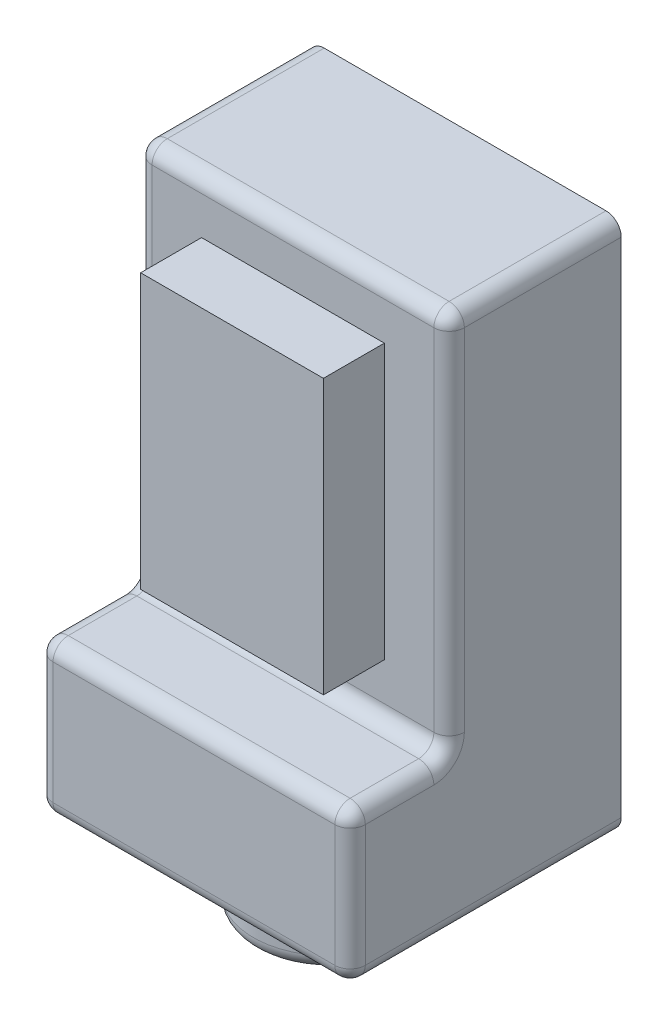
ISO-10303-21;
HEADER;
FILE_DESCRIPTION(('STEP AP214'),'2;1');
FILE_NAME('part.step','',(''),(''),'','','');
FILE_SCHEMA(('AUTOMOTIVE_DESIGN { 1 0 10303 214 1 1 1 1 }'));
ENDSEC;
DATA;
#1=APPLICATION_CONTEXT('core data for automotive mechanical design processes');
#2=APPLICATION_PROTOCOL_DEFINITION('international standard','automotive_design',2000,#1);
#3=PRODUCT_CONTEXT('',#1,'mechanical');
#4=PRODUCT('Part','Part','',(#3));
#5=PRODUCT_RELATED_PRODUCT_CATEGORY('part','',(#4));
#6=PRODUCT_DEFINITION_FORMATION('','',#4);
#7=PRODUCT_DEFINITION_CONTEXT('part definition',#1,'design');
#8=PRODUCT_DEFINITION('design','',#6,#7);
#9=PRODUCT_DEFINITION_SHAPE('','',#8);
#10=(LENGTH_UNIT() NAMED_UNIT(*) SI_UNIT(.MILLI.,.METRE.));
#11=(NAMED_UNIT(*) PLANE_ANGLE_UNIT() SI_UNIT($,.RADIAN.));
#12=(NAMED_UNIT(*) SI_UNIT($,.STERADIAN.) SOLID_ANGLE_UNIT());
#13=UNCERTAINTY_MEASURE_WITH_UNIT(LENGTH_MEASURE(1.E-05),#10,'distance_accuracy_value','');
#14=(GEOMETRIC_REPRESENTATION_CONTEXT(3) GLOBAL_UNCERTAINTY_ASSIGNED_CONTEXT((#13)) GLOBAL_UNIT_ASSIGNED_CONTEXT((#10,
#11,#12)) REPRESENTATION_CONTEXT('',''));
#15=CARTESIAN_POINT('',(0.,0.,0.));
#16=DIRECTION('',(0.,0.,1.));
#17=DIRECTION('',(1.,0.,0.));
#18=AXIS2_PLACEMENT_3D('',#15,#16,#17);
#19=CARTESIAN_POINT('',(0.,0.,11.3));
#20=DIRECTION('',(0.,0.,1.));
#21=DIRECTION('',(1.,0.,0.));
#22=AXIS2_PLACEMENT_3D('',#19,#20,#21);
#23=PLANE('',#22);
#24=DIRECTION('',(0.,1.,0.));
#25=VECTOR('',#24,1.);
#26=CARTESIAN_POINT('',(9.25,17.5,11.3));
#27=LINE('',#26,#25);
#28=CARTESIAN_POINT('',(9.25,-6.5,11.3));
#29=VERTEX_POINT('',#28);
#30=CARTESIAN_POINT('',(9.25,16.5,11.3));
#31=VERTEX_POINT('',#30);
#32=EDGE_CURVE('E288',#29,#31,#27,.T.);
#33=ORIENTED_EDGE('',*,*,#32,.T.);
#34=DIRECTION('',(-1.,0.,0.));
#35=VECTOR('',#34,1.);
#36=CARTESIAN_POINT('',(-10.25,16.5,11.3));
#37=LINE('',#36,#35);
#38=CARTESIAN_POINT('',(-9.25,16.5,11.3));
#39=VERTEX_POINT('',#38);
#40=EDGE_CURVE('E290',#31,#39,#37,.T.);
#41=ORIENTED_EDGE('',*,*,#40,.T.);
#42=DIRECTION('',(0.,-1.,0.));
#43=VECTOR('',#42,1.);
#44=CARTESIAN_POINT('',(-9.25,-7.5,11.3));
#45=LINE('',#44,#43);
#46=CARTESIAN_POINT('',(-9.25,-6.5,11.3));
#47=VERTEX_POINT('',#46);
#48=EDGE_CURVE('E284',#39,#47,#45,.T.);
#49=ORIENTED_EDGE('',*,*,#48,.T.);
#50=DIRECTION('',(1.,0.,0.));
#51=VECTOR('',#50,1.);
#52=CARTESIAN_POINT('',(0.,-6.5,11.3));
#53=LINE('',#52,#51);
#54=EDGE_CURVE('E286',#47,#29,#53,.T.);
#55=ORIENTED_EDGE('',*,*,#54,.T.);
#56=EDGE_LOOP('',(#33,#41,#49,#55));
#57=FACE_BOUND('',#56,.T.);
#58=DIRECTION('',(1.,0.,0.));
#59=VECTOR('',#58,1.);
#60=CARTESIAN_POINT('',(6.,-4.,11.3));
#61=LINE('',#60,#59);
#62=CARTESIAN_POINT('',(-6.,-4.,11.3));
#63=VERTEX_POINT('',#62);
#64=CARTESIAN_POINT('',(6.,-4.,11.3));
#65=VERTEX_POINT('',#64);
#66=EDGE_CURVE('E823',#63,#65,#61,.T.);
#67=ORIENTED_EDGE('',*,*,#66,.F.);
#68=DIRECTION('',(0.,-1.,0.));
#69=VECTOR('',#68,1.);
#70=CARTESIAN_POINT('',(-6.,-4.,11.3));
#71=LINE('',#70,#69);
#72=CARTESIAN_POINT('',(-6.,14.,11.3));
#73=VERTEX_POINT('',#72);
#74=EDGE_CURVE('E204',#73,#63,#71,.T.);
#75=ORIENTED_EDGE('',*,*,#74,.F.);
#76=DIRECTION('',(-1.,0.,0.));
#77=VECTOR('',#76,1.);
#78=CARTESIAN_POINT('',(6.,14.,11.3));
#79=LINE('',#78,#77);
#80=CARTESIAN_POINT('',(6.,14.,11.3));
#81=VERTEX_POINT('',#80);
#82=EDGE_CURVE('E200',#81,#73,#79,.T.);
#83=ORIENTED_EDGE('',*,*,#82,.F.);
#84=DIRECTION('',(0.,1.,0.));
#85=VECTOR('',#84,1.);
#86=CARTESIAN_POINT('',(6.,-4.,11.3));
#87=LINE('',#86,#85);
#88=EDGE_CURVE('E820',#65,#81,#87,.T.);
#89=ORIENTED_EDGE('',*,*,#88,.F.);
#90=EDGE_LOOP('',(#67,#75,#83,#89));
#91=FACE_BOUND('',#90,.T.);
#92=ADVANCED_FACE('F35',(#57,#91),#23,.T.);
#93=CARTESIAN_POINT('',(-10.25,17.5,17.8));
#94=DIRECTION('',(0.,-1.,0.));
#95=DIRECTION('',(0.,0.,-1.));
#96=AXIS2_PLACEMENT_3D('',#93,#94,#95);
#97=PLANE('',#96);
#98=DIRECTION('',(-1.,0.,0.));
#99=VECTOR('',#98,1.);
#100=CARTESIAN_POINT('',(-10.25,17.5,0.));
#101=LINE('',#100,#99);
#102=CARTESIAN_POINT('',(9.25,17.5,0.));
#103=VERTEX_POINT('',#102);
#104=CARTESIAN_POINT('',(-9.25,17.5,0.));
#105=VERTEX_POINT('',#104);
#106=EDGE_CURVE('E227',#103,#105,#101,.T.);
#107=ORIENTED_EDGE('',*,*,#106,.T.);
#108=DIRECTION('',(0.,0.,-1.));
#109=VECTOR('',#108,1.);
#110=CARTESIAN_POINT('',(-9.25,17.5,17.8));
#111=LINE('',#110,#109);
#112=CARTESIAN_POINT('',(-9.25,17.5,10.3));
#113=VERTEX_POINT('',#112);
#114=EDGE_CURVE('E60',#105,#113,#111,.F.);
#115=ORIENTED_EDGE('',*,*,#114,.T.);
#116=DIRECTION('',(-1.,0.,0.));
#117=VECTOR('',#116,1.);
#118=CARTESIAN_POINT('',(10.25,17.5,10.3));
#119=LINE('',#118,#117);
#120=CARTESIAN_POINT('',(9.25,17.5,10.3));
#121=VERTEX_POINT('',#120);
#122=EDGE_CURVE('E295',#113,#121,#119,.F.);
#123=ORIENTED_EDGE('',*,*,#122,.T.);
#124=DIRECTION('',(0.,0.,-1.));
#125=VECTOR('',#124,1.);
#126=CARTESIAN_POINT('',(9.25,17.5,17.8));
#127=LINE('',#126,#125);
#128=EDGE_CURVE('E293',#121,#103,#127,.T.);
#129=ORIENTED_EDGE('',*,*,#128,.T.);
#130=EDGE_LOOP('',(#107,#115,#123,#129));
#131=FACE_BOUND('',#130,.T.);
#132=ADVANCED_FACE('F412',(#131),#97,.F.);
#133=CARTESIAN_POINT('',(10.25,-17.5,17.8));
#134=DIRECTION('',(-1.,0.,0.));
#135=DIRECTION('',(0.,0.,1.));
#136=AXIS2_PLACEMENT_3D('',#133,#134,#135);
#137=PLANE('',#136);
#138=DIRECTION('',(0.,1.,0.));
#139=VECTOR('',#138,1.);
#140=CARTESIAN_POINT('',(10.25,-17.5,16.8));
#141=LINE('',#140,#139);
#142=CARTESIAN_POINT('',(10.25,-8.5,16.8));
#143=VERTEX_POINT('',#142);
#144=CARTESIAN_POINT('',(10.25,-16.5,16.8));
#145=VERTEX_POINT('',#144);
#146=EDGE_CURVE('E271',#143,#145,#141,.F.);
#147=ORIENTED_EDGE('',*,*,#146,.T.);
#148=DIRECTION('',(0.,0.,-1.));
#149=VECTOR('',#148,1.);
#150=CARTESIAN_POINT('',(10.25,-16.5,17.8));
#151=LINE('',#150,#149);
#152=CARTESIAN_POINT('',(10.25,-16.5,0.));
#153=VERTEX_POINT('',#152);
#154=EDGE_CURVE('E273',#145,#153,#151,.T.);
#155=ORIENTED_EDGE('',*,*,#154,.T.);
#156=DIRECTION('',(0.,1.,0.));
#157=VECTOR('',#156,1.);
#158=CARTESIAN_POINT('',(10.25,-17.5,0.));
#159=LINE('',#158,#157);
#160=CARTESIAN_POINT('',(10.25,16.5,0.));
#161=VERTEX_POINT('',#160);
#162=EDGE_CURVE('E219',#153,#161,#159,.T.);
#163=ORIENTED_EDGE('',*,*,#162,.T.);
#164=DIRECTION('',(0.,0.,-1.));
#165=VECTOR('',#164,1.);
#166=CARTESIAN_POINT('',(10.25,16.5,17.8));
#167=LINE('',#166,#165);
#168=CARTESIAN_POINT('',(10.25,16.5,10.3));
#169=VERTEX_POINT('',#168);
#170=EDGE_CURVE('E262',#161,#169,#167,.F.);
#171=ORIENTED_EDGE('',*,*,#170,.T.);
#172=DIRECTION('',(0.,1.,0.));
#173=VECTOR('',#172,1.);
#174=CARTESIAN_POINT('',(10.25,-7.5,10.3));
#175=LINE('',#174,#173);
#176=CARTESIAN_POINT('',(10.25,-6.5,10.3));
#177=VERTEX_POINT('',#176);
#178=EDGE_CURVE('E264',#169,#177,#175,.F.);
#179=ORIENTED_EDGE('',*,*,#178,.T.);
#180=CARTESIAN_POINT('',(10.25,-6.5,12.3));
#181=DIRECTION('',(-1.,0.,0.));
#182=DIRECTION('',(0.,0.,1.));
#183=AXIS2_PLACEMENT_3D('',#180,#181,#182);
#184=CIRCLE('',#183,2.);
#185=CARTESIAN_POINT('',(10.25,-8.5,12.3));
#186=VERTEX_POINT('',#185);
#187=EDGE_CURVE('E266',#186,#177,#184,.F.);
#188=ORIENTED_EDGE('',*,*,#187,.F.);
#189=DIRECTION('',(0.,0.,1.));
#190=VECTOR('',#189,1.);
#191=CARTESIAN_POINT('',(10.25,-8.5,17.8));
#192=LINE('',#191,#190);
#193=EDGE_CURVE('E269',#186,#143,#192,.T.);
#194=ORIENTED_EDGE('',*,*,#193,.T.);
#195=EDGE_LOOP('',(#147,#155,#163,#171,#179,#188,#194));
#196=FACE_BOUND('',#195,.T.);
#197=ADVANCED_FACE('F452',(#196),#137,.F.);
#198=CARTESIAN_POINT('',(-10.25,-17.5,17.8));
#199=DIRECTION('',(1.,0.,0.));
#200=DIRECTION('',(0.,0.,-1.));
#201=AXIS2_PLACEMENT_3D('',#198,#199,#200);
#202=PLANE('',#201);
#203=DIRECTION('',(0.,-1.,0.));
#204=VECTOR('',#203,1.);
#205=CARTESIAN_POINT('',(-10.25,-17.5,0.));
#206=LINE('',#205,#204);
#207=CARTESIAN_POINT('',(-10.25,16.5,0.));
#208=VERTEX_POINT('',#207);
#209=CARTESIAN_POINT('',(-10.25,-16.5,0.));
#210=VERTEX_POINT('',#209);
#211=EDGE_CURVE('E229',#208,#210,#206,.T.);
#212=ORIENTED_EDGE('',*,*,#211,.T.);
#213=DIRECTION('',(0.,0.,-1.));
#214=VECTOR('',#213,1.);
#215=CARTESIAN_POINT('',(-10.25,-16.5,17.8));
#216=LINE('',#215,#214);
#217=CARTESIAN_POINT('',(-10.25,-16.5,16.8));
#218=VERTEX_POINT('',#217);
#219=EDGE_CURVE('E260',#210,#218,#216,.F.);
#220=ORIENTED_EDGE('',*,*,#219,.T.);
#221=DIRECTION('',(0.,-1.,0.));
#222=VECTOR('',#221,1.);
#223=CARTESIAN_POINT('',(-10.25,-17.5,16.8));
#224=LINE('',#223,#222);
#225=CARTESIAN_POINT('',(-10.25,-8.5,16.8));
#226=VERTEX_POINT('',#225);
#227=EDGE_CURVE('E258',#218,#226,#224,.F.);
#228=ORIENTED_EDGE('',*,*,#227,.T.);
#229=DIRECTION('',(0.,0.,1.));
#230=VECTOR('',#229,1.);
#231=CARTESIAN_POINT('',(-10.25,-8.5,17.8));
#232=LINE('',#231,#230);
#233=CARTESIAN_POINT('',(-10.25,-8.5,12.3));
#234=VERTEX_POINT('',#233);
#235=EDGE_CURVE('E256',#226,#234,#232,.F.);
#236=ORIENTED_EDGE('',*,*,#235,.T.);
#237=CARTESIAN_POINT('',(-10.25,-6.5,12.3));
#238=DIRECTION('',(1.,0.,0.));
#239=DIRECTION('',(0.,0.,-1.));
#240=AXIS2_PLACEMENT_3D('',#237,#238,#239);
#241=CIRCLE('',#240,2.);
#242=CARTESIAN_POINT('',(-10.25,-6.5,10.3));
#243=VERTEX_POINT('',#242);
#244=EDGE_CURVE('E253',#243,#234,#241,.F.);
#245=ORIENTED_EDGE('',*,*,#244,.F.);
#246=DIRECTION('',(0.,-1.,0.));
#247=VECTOR('',#246,1.);
#248=CARTESIAN_POINT('',(-10.25,17.5,10.3));
#249=LINE('',#248,#247);
#250=CARTESIAN_POINT('',(-10.25,16.5,10.3));
#251=VERTEX_POINT('',#250);
#252=EDGE_CURVE('E251',#243,#251,#249,.F.);
#253=ORIENTED_EDGE('',*,*,#252,.T.);
#254=DIRECTION('',(0.,0.,-1.));
#255=VECTOR('',#254,1.);
#256=CARTESIAN_POINT('',(-10.25,16.5,17.8));
#257=LINE('',#256,#255);
#258=EDGE_CURVE('E249',#251,#208,#257,.T.);
#259=ORIENTED_EDGE('',*,*,#258,.T.);
#260=EDGE_LOOP('',(#212,#220,#228,#236,#245,#253,#259));
#261=FACE_BOUND('',#260,.T.);
#262=ADVANCED_FACE('F420',(#261),#202,.F.);
#263=CARTESIAN_POINT('',(-10.25,-17.5,17.8));
#264=DIRECTION('',(0.,1.,0.));
#265=DIRECTION('',(0.,0.,1.));
#266=AXIS2_PLACEMENT_3D('',#263,#264,#265);
#267=PLANE('',#266);
#268=CARTESIAN_POINT('',(0.,-17.5,8.9));
#269=DIRECTION('',(0.,-1.,0.));
#270=DIRECTION('',(0.,0.,-1.));
#271=AXIS2_PLACEMENT_3D('',#268,#269,#270);
#272=CIRCLE('',#271,3.);
#273=CARTESIAN_POINT('',(0.,-17.5,5.9));
#274=VERTEX_POINT('',#273);
#275=EDGE_CURVE('E220',#274,#274,#272,.T.);
#276=ORIENTED_EDGE('',*,*,#275,.F.);
#277=EDGE_LOOP('',(#276));
#278=FACE_BOUND('',#277,.T.);
#279=DIRECTION('',(1.,0.,0.));
#280=VECTOR('',#279,1.);
#281=CARTESIAN_POINT('',(-10.25,-17.5,0.));
#282=LINE('',#281,#280);
#283=CARTESIAN_POINT('',(-9.25,-17.5,0.));
#284=VERTEX_POINT('',#283);
#285=CARTESIAN_POINT('',(9.25,-17.5,0.));
#286=VERTEX_POINT('',#285);
#287=EDGE_CURVE('E224',#284,#286,#282,.T.);
#288=ORIENTED_EDGE('',*,*,#287,.T.);
#289=DIRECTION('',(0.,0.,-1.));
#290=VECTOR('',#289,1.);
#291=CARTESIAN_POINT('',(9.25,-17.5,17.8));
#292=LINE('',#291,#290);
#293=CARTESIAN_POINT('',(9.25,-17.5,16.8));
#294=VERTEX_POINT('',#293);
#295=EDGE_CURVE('E247',#286,#294,#292,.F.);
#296=ORIENTED_EDGE('',*,*,#295,.T.);
#297=DIRECTION('',(1.,0.,0.));
#298=VECTOR('',#297,1.);
#299=CARTESIAN_POINT('',(-10.25,-17.5,16.8));
#300=LINE('',#299,#298);
#301=CARTESIAN_POINT('',(-9.25,-17.5,16.8));
#302=VERTEX_POINT('',#301);
#303=EDGE_CURVE('E244',#294,#302,#300,.F.);
#304=ORIENTED_EDGE('',*,*,#303,.T.);
#305=DIRECTION('',(0.,0.,-1.));
#306=VECTOR('',#305,1.);
#307=CARTESIAN_POINT('',(-9.25,-17.5,17.8));
#308=LINE('',#307,#306);
#309=EDGE_CURVE('E242',#302,#284,#308,.T.);
#310=ORIENTED_EDGE('',*,*,#309,.T.);
#311=EDGE_LOOP('',(#288,#296,#304,#310));
#312=FACE_BOUND('',#311,.T.);
#313=ADVANCED_FACE('F462',(#278,#312),#267,.F.);
#314=CARTESIAN_POINT('',(0.,0.,17.8));
#315=DIRECTION('',(0.,0.,-1.));
#316=DIRECTION('',(-1.,0.,0.));
#317=AXIS2_PLACEMENT_3D('',#314,#315,#316);
#318=PLANE('',#317);
#319=DIRECTION('',(0.,-1.,0.));
#320=VECTOR('',#319,1.);
#321=CARTESIAN_POINT('',(-9.25,0.,17.8));
#322=LINE('',#321,#320);
#323=CARTESIAN_POINT('',(-9.25,-8.5,17.8));
#324=VERTEX_POINT('',#323);
#325=CARTESIAN_POINT('',(-9.25,-16.5,17.8));
#326=VERTEX_POINT('',#325);
#327=EDGE_CURVE('E237',#324,#326,#322,.T.);
#328=ORIENTED_EDGE('',*,*,#327,.T.);
#329=DIRECTION('',(1.,0.,0.));
#330=VECTOR('',#329,1.);
#331=CARTESIAN_POINT('',(0.,-16.5,17.8));
#332=LINE('',#331,#330);
#333=CARTESIAN_POINT('',(9.25,-16.5,17.8));
#334=VERTEX_POINT('',#333);
#335=EDGE_CURVE('E239',#326,#334,#332,.T.);
#336=ORIENTED_EDGE('',*,*,#335,.T.);
#337=DIRECTION('',(0.,1.,0.));
#338=VECTOR('',#337,1.);
#339=CARTESIAN_POINT('',(9.25,0.,17.8));
#340=LINE('',#339,#338);
#341=CARTESIAN_POINT('',(9.25,-8.5,17.8));
#342=VERTEX_POINT('',#341);
#343=EDGE_CURVE('E235',#334,#342,#340,.T.);
#344=ORIENTED_EDGE('',*,*,#343,.T.);
#345=DIRECTION('',(1.,0.,0.));
#346=VECTOR('',#345,1.);
#347=CARTESIAN_POINT('',(0.,-8.5,17.8));
#348=LINE('',#347,#346);
#349=EDGE_CURVE('E223',#342,#324,#348,.F.);
#350=ORIENTED_EDGE('',*,*,#349,.T.);
#351=EDGE_LOOP('',(#328,#336,#344,#350));
#352=FACE_BOUND('',#351,.T.);
#353=ADVANCED_FACE('F511',(#352),#318,.F.);
#354=CARTESIAN_POINT('',(0.,0.,0.));
#355=DIRECTION('',(0.,0.,-1.));
#356=DIRECTION('',(-1.,0.,0.));
#357=AXIS2_PLACEMENT_3D('',#354,#355,#356);
#358=PLANE('',#357);
#359=ORIENTED_EDGE('',*,*,#162,.F.);
#360=CARTESIAN_POINT('',(9.25,-16.5,0.));
#361=DIRECTION('',(0.,0.,-1.));
#362=DIRECTION('',(-1.,0.,0.));
#363=AXIS2_PLACEMENT_3D('',#360,#361,#362);
#364=CIRCLE('',#363,1.);
#365=EDGE_CURVE('E304',#153,#286,#364,.T.);
#366=ORIENTED_EDGE('',*,*,#365,.T.);
#367=ORIENTED_EDGE('',*,*,#287,.F.);
#368=CARTESIAN_POINT('',(-9.25,-16.5,0.));
#369=DIRECTION('',(0.,0.,-1.));
#370=DIRECTION('',(-1.,0.,0.));
#371=AXIS2_PLACEMENT_3D('',#368,#369,#370);
#372=CIRCLE('',#371,1.);
#373=EDGE_CURVE('E302',#284,#210,#372,.T.);
#374=ORIENTED_EDGE('',*,*,#373,.T.);
#375=ORIENTED_EDGE('',*,*,#211,.F.);
#376=CARTESIAN_POINT('',(-9.25,16.5,0.));
#377=DIRECTION('',(0.,0.,-1.));
#378=DIRECTION('',(-1.,0.,0.));
#379=AXIS2_PLACEMENT_3D('',#376,#377,#378);
#380=CIRCLE('',#379,1.);
#381=EDGE_CURVE('E300',#208,#105,#380,.T.);
#382=ORIENTED_EDGE('',*,*,#381,.T.);
#383=ORIENTED_EDGE('',*,*,#106,.F.);
#384=CARTESIAN_POINT('',(9.25,16.5,0.));
#385=DIRECTION('',(0.,0.,-1.));
#386=DIRECTION('',(-1.,0.,0.));
#387=AXIS2_PLACEMENT_3D('',#384,#385,#386);
#388=CIRCLE('',#387,1.);
#389=EDGE_CURVE('E298',#103,#161,#388,.T.);
#390=ORIENTED_EDGE('',*,*,#389,.T.);
#391=EDGE_LOOP('',(#359,#366,#367,#374,#375,#382,#383,#390));
#392=FACE_BOUND('',#391,.T.);
#393=ADVANCED_FACE('F415',(#392),#358,.T.);
#394=CARTESIAN_POINT('',(0.,-19.5,8.9));
#395=DIRECTION('',(0.,1.,0.));
#396=DIRECTION('',(0.,0.,1.));
#397=AXIS2_PLACEMENT_3D('',#394,#395,#396);
#398=CYLINDRICAL_SURFACE('',#397,3.);
#399=CARTESIAN_POINT('',(0.,-19.5,8.9));
#400=DIRECTION('',(0.,-1.,0.));
#401=DIRECTION('',(0.,0.,-1.));
#402=AXIS2_PLACEMENT_3D('',#399,#400,#401);
#403=CIRCLE('',#402,3.);
#404=CARTESIAN_POINT('',(0.,-19.5,5.9));
#405=VERTEX_POINT('',#404);
#406=EDGE_CURVE('E216',#405,#405,#403,.T.);
#407=ORIENTED_EDGE('',*,*,#406,.F.);
#408=EDGE_LOOP('',(#407));
#409=FACE_BOUND('',#408,.T.);
#410=ORIENTED_EDGE('',*,*,#275,.T.);
#411=EDGE_LOOP('',(#410));
#412=FACE_BOUND('',#411,.T.);
#413=ADVANCED_FACE('F506',(#409,#412),#398,.T.);
#414=CARTESIAN_POINT('',(0.,-22.5,8.9));
#415=DIRECTION('',(0.,1.,0.));
#416=DIRECTION('',(0.,0.,1.));
#417=AXIS2_PLACEMENT_3D('',#414,#415,#416);
#418=CYLINDRICAL_SURFACE('',#417,5.);
#419=CARTESIAN_POINT('',(0.,-21.5,8.9));
#420=DIRECTION('',(0.,-1.,0.));
#421=DIRECTION('',(0.,0.,-1.));
#422=AXIS2_PLACEMENT_3D('',#419,#420,#421);
#423=CIRCLE('',#422,5.);
#424=CARTESIAN_POINT('',(0.,-21.5,3.9));
#425=VERTEX_POINT('',#424);
#426=EDGE_CURVE('E11',#425,#425,#423,.F.);
#427=ORIENTED_EDGE('',*,*,#426,.T.);
#428=EDGE_LOOP('',(#427));
#429=FACE_BOUND('',#428,.T.);
#430=CARTESIAN_POINT('',(0.,-19.5,8.9));
#431=DIRECTION('',(0.,-1.,0.));
#432=DIRECTION('',(0.,0.,-1.));
#433=AXIS2_PLACEMENT_3D('',#430,#431,#432);
#434=CIRCLE('',#433,5.);
#435=CARTESIAN_POINT('',(0.,-19.5,3.9));
#436=VERTEX_POINT('',#435);
#437=EDGE_CURVE('E213',#436,#436,#434,.T.);
#438=ORIENTED_EDGE('',*,*,#437,.T.);
#439=EDGE_LOOP('',(#438));
#440=FACE_BOUND('',#439,.T.);
#441=ADVANCED_FACE('F499',(#429,#440),#418,.T.);
#442=CARTESIAN_POINT('',(0.,-22.5,8.9));
#443=DIRECTION('',(0.,-1.,0.));
#444=DIRECTION('',(0.,0.,-1.));
#445=AXIS2_PLACEMENT_3D('',#442,#443,#444);
#446=PLANE('',#445);
#447=CARTESIAN_POINT('',(0.,-22.5,8.9));
#448=DIRECTION('',(0.,-1.,0.));
#449=DIRECTION('',(0.,0.,-1.));
#450=AXIS2_PLACEMENT_3D('',#447,#448,#449);
#451=CIRCLE('',#450,4.);
#452=CARTESIAN_POINT('',(0.,-22.5,4.9));
#453=VERTEX_POINT('',#452);
#454=EDGE_CURVE('E44',#453,#453,#451,.T.);
#455=ORIENTED_EDGE('',*,*,#454,.T.);
#456=EDGE_LOOP('',(#455));
#457=FACE_BOUND('',#456,.T.);
#458=ADVANCED_FACE('F496',(#457),#446,.T.);
#459=CARTESIAN_POINT('',(0.,-19.5,8.9));
#460=DIRECTION('',(0.,-1.,0.));
#461=DIRECTION('',(0.,0.,-1.));
#462=AXIS2_PLACEMENT_3D('',#459,#460,#461);
#463=PLANE('',#462);
#464=ORIENTED_EDGE('',*,*,#406,.T.);
#465=EDGE_LOOP('',(#464));
#466=FACE_BOUND('',#465,.T.);
#467=ORIENTED_EDGE('',*,*,#437,.F.);
#468=EDGE_LOOP('',(#467));
#469=FACE_BOUND('',#468,.T.);
#470=ADVANCED_FACE('F495',(#466,#469),#463,.F.);
#471=CARTESIAN_POINT('',(-10.25,-7.5,11.3));
#472=DIRECTION('',(0.,-1.,0.));
#473=DIRECTION('',(0.,0.,-1.));
#474=AXIS2_PLACEMENT_3D('',#471,#472,#473);
#475=PLANE('',#474);
#476=DIRECTION('',(0.,0.,1.));
#477=VECTOR('',#476,1.);
#478=CARTESIAN_POINT('',(-9.25,-7.5,11.3));
#479=LINE('',#478,#477);
#480=CARTESIAN_POINT('',(-9.25,-7.5,12.3));
#481=VERTEX_POINT('',#480);
#482=CARTESIAN_POINT('',(-9.25,-7.5,16.8));
#483=VERTEX_POINT('',#482);
#484=EDGE_CURVE('E279',#481,#483,#479,.T.);
#485=ORIENTED_EDGE('',*,*,#484,.T.);
#486=DIRECTION('',(1.,0.,0.));
#487=VECTOR('',#486,1.);
#488=CARTESIAN_POINT('',(-10.25,-7.5,16.8));
#489=LINE('',#488,#487);
#490=CARTESIAN_POINT('',(9.25,-7.5,16.8));
#491=VERTEX_POINT('',#490);
#492=EDGE_CURVE('E282',#483,#491,#489,.T.);
#493=ORIENTED_EDGE('',*,*,#492,.T.);
#494=DIRECTION('',(0.,0.,1.));
#495=VECTOR('',#494,1.);
#496=CARTESIAN_POINT('',(9.25,-7.5,11.3));
#497=LINE('',#496,#495);
#498=CARTESIAN_POINT('',(9.25,-7.5,12.3));
#499=VERTEX_POINT('',#498);
#500=EDGE_CURVE('E277',#491,#499,#497,.F.);
#501=ORIENTED_EDGE('',*,*,#500,.T.);
#502=DIRECTION('',(1.,0.,0.));
#503=VECTOR('',#502,1.);
#504=CARTESIAN_POINT('',(-10.25,-7.5,12.3));
#505=LINE('',#504,#503);
#506=EDGE_CURVE('E275',#499,#481,#505,.F.);
#507=ORIENTED_EDGE('',*,*,#506,.T.);
#508=EDGE_LOOP('',(#485,#493,#501,#507));
#509=FACE_BOUND('',#508,.T.);
#510=ADVANCED_FACE('F431',(#509),#475,.F.);
#511=CARTESIAN_POINT('',(-9.25,16.5,17.8));
#512=DIRECTION('',(0.,0.,-1.));
#513=DIRECTION('',(-1.,0.,0.));
#514=AXIS2_PLACEMENT_3D('',#511,#512,#513);
#515=CYLINDRICAL_SURFACE('',#514,1.);
#516=ORIENTED_EDGE('',*,*,#381,.F.);
#517=ORIENTED_EDGE('',*,*,#258,.F.);
#518=CARTESIAN_POINT('',(-9.25,16.5,10.3));
#519=DIRECTION('',(0.,0.,1.));
#520=DIRECTION('',(1.,0.,0.));
#521=AXIS2_PLACEMENT_3D('',#518,#519,#520);
#522=CIRCLE('',#521,1.);
#523=EDGE_CURVE('E39',#113,#251,#522,.T.);
#524=ORIENTED_EDGE('',*,*,#523,.F.);
#525=ORIENTED_EDGE('',*,*,#114,.F.);
#526=EDGE_LOOP('',(#516,#517,#524,#525));
#527=FACE_BOUND('',#526,.T.);
#528=ADVANCED_FACE('F418',(#527),#515,.T.);
#529=CARTESIAN_POINT('',(0.,16.5,10.3));
#530=DIRECTION('',(1.,0.,0.));
#531=DIRECTION('',(0.,0.,-1.));
#532=AXIS2_PLACEMENT_3D('',#529,#530,#531);
#533=CYLINDRICAL_SURFACE('',#532,1.);
#534=CARTESIAN_POINT('',(9.25,16.5,10.3));
#535=DIRECTION('',(1.,0.,0.));
#536=DIRECTION('',(0.,0.,-1.));
#537=AXIS2_PLACEMENT_3D('',#534,#535,#536);
#538=CIRCLE('',#537,1.);
#539=EDGE_CURVE('E365',#121,#31,#538,.T.);
#540=ORIENTED_EDGE('',*,*,#539,.F.);
#541=ORIENTED_EDGE('',*,*,#122,.F.);
#542=CARTESIAN_POINT('',(-9.25,16.5,10.3));
#543=DIRECTION('',(-1.,0.,0.));
#544=DIRECTION('',(0.,0.,1.));
#545=AXIS2_PLACEMENT_3D('',#542,#543,#544);
#546=CIRCLE('',#545,1.);
#547=EDGE_CURVE('E367',#39,#113,#546,.T.);
#548=ORIENTED_EDGE('',*,*,#547,.F.);
#549=ORIENTED_EDGE('',*,*,#40,.F.);
#550=EDGE_LOOP('',(#540,#541,#548,#549));
#551=FACE_BOUND('',#550,.T.);
#552=ADVANCED_FACE('F402',(#551),#533,.T.);
#553=CARTESIAN_POINT('',(9.25,16.5,17.8));
#554=DIRECTION('',(0.,0.,-1.));
#555=DIRECTION('',(-1.,0.,0.));
#556=AXIS2_PLACEMENT_3D('',#553,#554,#555);
#557=CYLINDRICAL_SURFACE('',#556,1.);
#558=ORIENTED_EDGE('',*,*,#389,.F.);
#559=ORIENTED_EDGE('',*,*,#128,.F.);
#560=CARTESIAN_POINT('',(9.25,16.5,10.3));
#561=DIRECTION('',(0.,0.,1.));
#562=DIRECTION('',(1.,0.,0.));
#563=AXIS2_PLACEMENT_3D('',#560,#561,#562);
#564=CIRCLE('',#563,1.);
#565=EDGE_CURVE('E362',#169,#121,#564,.T.);
#566=ORIENTED_EDGE('',*,*,#565,.F.);
#567=ORIENTED_EDGE('',*,*,#170,.F.);
#568=EDGE_LOOP('',(#558,#559,#566,#567));
#569=FACE_BOUND('',#568,.T.);
#570=ADVANCED_FACE('F410',(#569),#557,.T.);
#571=CARTESIAN_POINT('',(-9.25,16.5,10.3));
#572=DIRECTION('',(0.,0.,1.));
#573=DIRECTION('',(1.,0.,0.));
#574=AXIS2_PLACEMENT_3D('',#571,#572,#573);
#575=SPHERICAL_SURFACE('',#574,1.);
#576=ORIENTED_EDGE('',*,*,#547,.T.);
#577=ORIENTED_EDGE('',*,*,#523,.T.);
#578=CARTESIAN_POINT('',(-9.25,16.5,10.3));
#579=DIRECTION('',(0.,1.,0.));
#580=DIRECTION('',(0.,0.,1.));
#581=AXIS2_PLACEMENT_3D('',#578,#579,#580);
#582=CIRCLE('',#581,1.);
#583=EDGE_CURVE('E359',#39,#251,#582,.F.);
#584=ORIENTED_EDGE('',*,*,#583,.F.);
#585=EDGE_LOOP('',(#576,#577,#584));
#586=FACE_BOUND('',#585,.T.);
#587=ADVANCED_FACE('F374',(#586),#575,.T.);
#588=CARTESIAN_POINT('',(9.25,16.5,10.3));
#589=DIRECTION('',(0.,0.,1.));
#590=DIRECTION('',(1.,0.,0.));
#591=AXIS2_PLACEMENT_3D('',#588,#589,#590);
#592=SPHERICAL_SURFACE('',#591,1.);
#593=ORIENTED_EDGE('',*,*,#565,.T.);
#594=ORIENTED_EDGE('',*,*,#539,.T.);
#595=CARTESIAN_POINT('',(9.25,16.5,10.3));
#596=DIRECTION('',(0.,1.,0.));
#597=DIRECTION('',(0.,0.,1.));
#598=AXIS2_PLACEMENT_3D('',#595,#596,#597);
#599=CIRCLE('',#598,1.);
#600=EDGE_CURVE('E356',#169,#31,#599,.F.);
#601=ORIENTED_EDGE('',*,*,#600,.F.);
#602=EDGE_LOOP('',(#593,#594,#601));
#603=FACE_BOUND('',#602,.T.);
#604=ADVANCED_FACE('F404',(#603),#592,.T.);
#605=CARTESIAN_POINT('',(-9.25,0.,10.3));
#606=DIRECTION('',(0.,1.,0.));
#607=DIRECTION('',(0.,0.,1.));
#608=AXIS2_PLACEMENT_3D('',#605,#606,#607);
#609=CYLINDRICAL_SURFACE('',#608,1.);
#610=ORIENTED_EDGE('',*,*,#583,.T.);
#611=ORIENTED_EDGE('',*,*,#252,.F.);
#612=CARTESIAN_POINT('',(-9.25,-6.5,10.3));
#613=DIRECTION('',(0.,-1.,0.));
#614=DIRECTION('',(0.,0.,-1.));
#615=AXIS2_PLACEMENT_3D('',#612,#613,#614);
#616=CIRCLE('',#615,1.);
#617=EDGE_CURVE('E353',#47,#243,#616,.T.);
#618=ORIENTED_EDGE('',*,*,#617,.F.);
#619=ORIENTED_EDGE('',*,*,#48,.F.);
#620=EDGE_LOOP('',(#610,#611,#618,#619));
#621=FACE_BOUND('',#620,.T.);
#622=ADVANCED_FACE('F379',(#621),#609,.T.);
#623=CARTESIAN_POINT('',(0.,-6.5,12.3));
#624=DIRECTION('',(1.,0.,0.));
#625=DIRECTION('',(0.,0.,-1.));
#626=AXIS2_PLACEMENT_3D('',#623,#624,#625);
#627=CYLINDRICAL_SURFACE('',#626,1.);
#628=CARTESIAN_POINT('',(9.25,-6.5,12.3));
#629=DIRECTION('',(-1.,0.,0.));
#630=DIRECTION('',(0.,0.,1.));
#631=AXIS2_PLACEMENT_3D('',#628,#629,#630);
#632=CIRCLE('',#631,1.);
#633=EDGE_CURVE('E347',#29,#499,#632,.T.);
#634=ORIENTED_EDGE('',*,*,#633,.F.);
#635=ORIENTED_EDGE('',*,*,#54,.F.);
#636=CARTESIAN_POINT('',(-9.25,-6.5,12.3));
#637=DIRECTION('',(1.,0.,0.));
#638=DIRECTION('',(0.,0.,-1.));
#639=AXIS2_PLACEMENT_3D('',#636,#637,#638);
#640=CIRCLE('',#639,1.);
#641=EDGE_CURVE('E350',#481,#47,#640,.T.);
#642=ORIENTED_EDGE('',*,*,#641,.F.);
#643=ORIENTED_EDGE('',*,*,#506,.F.);
#644=EDGE_LOOP('',(#634,#635,#642,#643));
#645=FACE_BOUND('',#644,.T.);
#646=ADVANCED_FACE('F389',(#645),#627,.F.);
#647=CARTESIAN_POINT('',(9.25,0.,10.3));
#648=DIRECTION('',(0.,-1.,0.));
#649=DIRECTION('',(0.,0.,-1.));
#650=AXIS2_PLACEMENT_3D('',#647,#648,#649);
#651=CYLINDRICAL_SURFACE('',#650,1.);
#652=ORIENTED_EDGE('',*,*,#600,.T.);
#653=ORIENTED_EDGE('',*,*,#32,.F.);
#654=CARTESIAN_POINT('',(9.25,-6.5,10.3));
#655=DIRECTION('',(0.,-1.,0.));
#656=DIRECTION('',(0.,0.,-1.));
#657=AXIS2_PLACEMENT_3D('',#654,#655,#656);
#658=CIRCLE('',#657,1.);
#659=EDGE_CURVE('E344',#177,#29,#658,.T.);
#660=ORIENTED_EDGE('',*,*,#659,.F.);
#661=ORIENTED_EDGE('',*,*,#178,.F.);
#662=EDGE_LOOP('',(#652,#653,#660,#661));
#663=FACE_BOUND('',#662,.T.);
#664=ADVANCED_FACE('F398',(#663),#651,.T.);
#665=CARTESIAN_POINT('',(-9.25,-6.5,12.3));
#666=DIRECTION('',(1.,0.,0.));
#667=DIRECTION('',(0.,0.,-1.));
#668=AXIS2_PLACEMENT_3D('',#665,#666,#667);
#669=TOROIDAL_SURFACE('',#668,2.,1.);
#670=ORIENTED_EDGE('',*,*,#617,.T.);
#671=ORIENTED_EDGE('',*,*,#244,.T.);
#672=CARTESIAN_POINT('',(-9.25,-8.5,12.3));
#673=DIRECTION('',(0.,0.,-1.));
#674=DIRECTION('',(-1.,0.,0.));
#675=AXIS2_PLACEMENT_3D('',#672,#673,#674);
#676=CIRCLE('',#675,1.);
#677=EDGE_CURVE('E341',#481,#234,#676,.F.);
#678=ORIENTED_EDGE('',*,*,#677,.F.);
#679=ORIENTED_EDGE('',*,*,#641,.T.);
#680=EDGE_LOOP('',(#670,#671,#678,#679));
#681=FACE_BOUND('',#680,.T.);
#682=ADVANCED_FACE('F424',(#681),#669,.T.);
#683=CARTESIAN_POINT('',(9.25,-6.5,12.3));
#684=DIRECTION('',(-1.,0.,0.));
#685=DIRECTION('',(0.,0.,1.));
#686=AXIS2_PLACEMENT_3D('',#683,#684,#685);
#687=TOROIDAL_SURFACE('',#686,2.,1.);
#688=ORIENTED_EDGE('',*,*,#659,.T.);
#689=ORIENTED_EDGE('',*,*,#633,.T.);
#690=CARTESIAN_POINT('',(9.25,-8.5,12.3));
#691=DIRECTION('',(0.,0.,-1.));
#692=DIRECTION('',(-1.,0.,0.));
#693=AXIS2_PLACEMENT_3D('',#690,#691,#692);
#694=CIRCLE('',#693,1.);
#695=EDGE_CURVE('E338',#186,#499,#694,.F.);
#696=ORIENTED_EDGE('',*,*,#695,.F.);
#697=ORIENTED_EDGE('',*,*,#187,.T.);
#698=EDGE_LOOP('',(#688,#689,#696,#697));
#699=FACE_BOUND('',#698,.T.);
#700=ADVANCED_FACE('F395',(#699),#687,.T.);
#701=CARTESIAN_POINT('',(-9.25,-8.5,11.3));
#702=DIRECTION('',(0.,0.,1.));
#703=DIRECTION('',(1.,0.,0.));
#704=AXIS2_PLACEMENT_3D('',#701,#702,#703);
#705=CYLINDRICAL_SURFACE('',#704,1.);
#706=ORIENTED_EDGE('',*,*,#677,.T.);
#707=ORIENTED_EDGE('',*,*,#235,.F.);
#708=CARTESIAN_POINT('',(-9.25,-8.5,16.8));
#709=DIRECTION('',(0.,0.,1.));
#710=DIRECTION('',(1.,0.,0.));
#711=AXIS2_PLACEMENT_3D('',#708,#709,#710);
#712=CIRCLE('',#711,1.);
#713=EDGE_CURVE('E335',#483,#226,#712,.T.);
#714=ORIENTED_EDGE('',*,*,#713,.F.);
#715=ORIENTED_EDGE('',*,*,#484,.F.);
#716=EDGE_LOOP('',(#706,#707,#714,#715));
#717=FACE_BOUND('',#716,.T.);
#718=ADVANCED_FACE('F427',(#717),#705,.T.);
#719=CARTESIAN_POINT('',(-10.25,-8.5,16.8));
#720=DIRECTION('',(1.,0.,0.));
#721=DIRECTION('',(0.,0.,-1.));
#722=AXIS2_PLACEMENT_3D('',#719,#720,#721);
#723=CYLINDRICAL_SURFACE('',#722,1.);
#724=CARTESIAN_POINT('',(9.25,-8.5,16.8));
#725=DIRECTION('',(1.,0.,0.));
#726=DIRECTION('',(0.,0.,-1.));
#727=AXIS2_PLACEMENT_3D('',#724,#725,#726);
#728=CIRCLE('',#727,1.);
#729=EDGE_CURVE('E330',#491,#342,#728,.T.);
#730=ORIENTED_EDGE('',*,*,#729,.F.);
#731=ORIENTED_EDGE('',*,*,#492,.F.);
#732=CARTESIAN_POINT('',(-9.25,-8.5,16.8));
#733=DIRECTION('',(-1.,0.,0.));
#734=DIRECTION('',(0.,0.,1.));
#735=AXIS2_PLACEMENT_3D('',#732,#733,#734);
#736=CIRCLE('',#735,1.);
#737=EDGE_CURVE('E333',#324,#483,#736,.T.);
#738=ORIENTED_EDGE('',*,*,#737,.F.);
#739=ORIENTED_EDGE('',*,*,#349,.F.);
#740=EDGE_LOOP('',(#730,#731,#738,#739));
#741=FACE_BOUND('',#740,.T.);
#742=ADVANCED_FACE('F441',(#741),#723,.T.);
#743=CARTESIAN_POINT('',(9.25,-8.5,17.8));
#744=DIRECTION('',(0.,0.,1.));
#745=DIRECTION('',(1.,0.,0.));
#746=AXIS2_PLACEMENT_3D('',#743,#744,#745);
#747=CYLINDRICAL_SURFACE('',#746,1.);
#748=ORIENTED_EDGE('',*,*,#695,.T.);
#749=ORIENTED_EDGE('',*,*,#500,.F.);
#750=CARTESIAN_POINT('',(9.25,-8.5,16.8));
#751=DIRECTION('',(0.,0.,1.));
#752=DIRECTION('',(1.,0.,0.));
#753=AXIS2_PLACEMENT_3D('',#750,#751,#752);
#754=CIRCLE('',#753,1.);
#755=EDGE_CURVE('E327',#143,#491,#754,.T.);
#756=ORIENTED_EDGE('',*,*,#755,.F.);
#757=ORIENTED_EDGE('',*,*,#193,.F.);
#758=EDGE_LOOP('',(#748,#749,#756,#757));
#759=FACE_BOUND('',#758,.T.);
#760=ADVANCED_FACE('F436',(#759),#747,.T.);
#761=CARTESIAN_POINT('',(-9.25,-8.5,16.8));
#762=DIRECTION('',(0.,0.,1.));
#763=DIRECTION('',(1.,0.,0.));
#764=AXIS2_PLACEMENT_3D('',#761,#762,#763);
#765=SPHERICAL_SURFACE('',#764,1.);
#766=ORIENTED_EDGE('',*,*,#737,.T.);
#767=ORIENTED_EDGE('',*,*,#713,.T.);
#768=CARTESIAN_POINT('',(-9.25,-8.5,16.8));
#769=DIRECTION('',(0.,1.,0.));
#770=DIRECTION('',(0.,0.,1.));
#771=AXIS2_PLACEMENT_3D('',#768,#769,#770);
#772=CIRCLE('',#771,1.);
#773=EDGE_CURVE('E324',#324,#226,#772,.F.);
#774=ORIENTED_EDGE('',*,*,#773,.F.);
#775=EDGE_LOOP('',(#766,#767,#774));
#776=FACE_BOUND('',#775,.T.);
#777=ADVANCED_FACE('F475',(#776),#765,.T.);
#778=CARTESIAN_POINT('',(9.25,-8.5,16.8));
#779=DIRECTION('',(0.,0.,1.));
#780=DIRECTION('',(1.,0.,0.));
#781=AXIS2_PLACEMENT_3D('',#778,#779,#780);
#782=SPHERICAL_SURFACE('',#781,1.);
#783=ORIENTED_EDGE('',*,*,#755,.T.);
#784=ORIENTED_EDGE('',*,*,#729,.T.);
#785=CARTESIAN_POINT('',(9.25,-8.5,16.8));
#786=DIRECTION('',(0.,1.,0.));
#787=DIRECTION('',(0.,0.,1.));
#788=AXIS2_PLACEMENT_3D('',#785,#786,#787);
#789=CIRCLE('',#788,1.);
#790=EDGE_CURVE('E321',#143,#342,#789,.F.);
#791=ORIENTED_EDGE('',*,*,#790,.F.);
#792=EDGE_LOOP('',(#783,#784,#791));
#793=FACE_BOUND('',#792,.T.);
#794=ADVANCED_FACE('F444',(#793),#782,.T.);
#795=CARTESIAN_POINT('',(-9.25,-16.5,17.8));
#796=DIRECTION('',(0.,0.,-1.));
#797=DIRECTION('',(-1.,0.,0.));
#798=AXIS2_PLACEMENT_3D('',#795,#796,#797);
#799=CYLINDRICAL_SURFACE('',#798,1.);
#800=ORIENTED_EDGE('',*,*,#373,.F.);
#801=ORIENTED_EDGE('',*,*,#309,.F.);
#802=CARTESIAN_POINT('',(-9.25,-16.5,16.8));
#803=DIRECTION('',(0.,0.,1.));
#804=DIRECTION('',(1.,0.,0.));
#805=AXIS2_PLACEMENT_3D('',#802,#803,#804);
#806=CIRCLE('',#805,1.);
#807=EDGE_CURVE('E318',#218,#302,#806,.T.);
#808=ORIENTED_EDGE('',*,*,#807,.F.);
#809=ORIENTED_EDGE('',*,*,#219,.F.);
#810=EDGE_LOOP('',(#800,#801,#808,#809));
#811=FACE_BOUND('',#810,.T.);
#812=ADVANCED_FACE('F466',(#811),#799,.T.);
#813=CARTESIAN_POINT('',(-9.25,0.,16.8));
#814=DIRECTION('',(0.,-1.,0.));
#815=DIRECTION('',(0.,0.,-1.));
#816=AXIS2_PLACEMENT_3D('',#813,#814,#815);
#817=CYLINDRICAL_SURFACE('',#816,1.);
#818=ORIENTED_EDGE('',*,*,#773,.T.);
#819=ORIENTED_EDGE('',*,*,#227,.F.);
#820=CARTESIAN_POINT('',(-9.25,-16.5,16.8));
#821=DIRECTION('',(0.,-1.,0.));
#822=DIRECTION('',(0.,0.,-1.));
#823=AXIS2_PLACEMENT_3D('',#820,#821,#822);
#824=CIRCLE('',#823,1.);
#825=EDGE_CURVE('E315',#326,#218,#824,.T.);
#826=ORIENTED_EDGE('',*,*,#825,.F.);
#827=ORIENTED_EDGE('',*,*,#327,.F.);
#828=EDGE_LOOP('',(#818,#819,#826,#827));
#829=FACE_BOUND('',#828,.T.);
#830=ADVANCED_FACE('F470',(#829),#817,.T.);
#831=CARTESIAN_POINT('',(9.25,0.,16.8));
#832=DIRECTION('',(0.,1.,0.));
#833=DIRECTION('',(0.,0.,1.));
#834=AXIS2_PLACEMENT_3D('',#831,#832,#833);
#835=CYLINDRICAL_SURFACE('',#834,1.);
#836=ORIENTED_EDGE('',*,*,#790,.T.);
#837=ORIENTED_EDGE('',*,*,#343,.F.);
#838=CARTESIAN_POINT('',(9.25,-16.5,16.8));
#839=DIRECTION('',(0.,-1.,0.));
#840=DIRECTION('',(0.,0.,-1.));
#841=AXIS2_PLACEMENT_3D('',#838,#839,#840);
#842=CIRCLE('',#841,1.);
#843=EDGE_CURVE('E312',#145,#334,#842,.T.);
#844=ORIENTED_EDGE('',*,*,#843,.F.);
#845=ORIENTED_EDGE('',*,*,#146,.F.);
#846=EDGE_LOOP('',(#836,#837,#844,#845));
#847=FACE_BOUND('',#846,.T.);
#848=ADVANCED_FACE('F449',(#847),#835,.T.);
#849=CARTESIAN_POINT('',(9.25,-16.5,17.8));
#850=DIRECTION('',(0.,0.,-1.));
#851=DIRECTION('',(-1.,0.,0.));
#852=AXIS2_PLACEMENT_3D('',#849,#850,#851);
#853=CYLINDRICAL_SURFACE('',#852,1.);
#854=ORIENTED_EDGE('',*,*,#365,.F.);
#855=ORIENTED_EDGE('',*,*,#154,.F.);
#856=CARTESIAN_POINT('',(9.25,-16.5,16.8));
#857=DIRECTION('',(0.,0.,1.));
#858=DIRECTION('',(1.,0.,0.));
#859=AXIS2_PLACEMENT_3D('',#856,#857,#858);
#860=CIRCLE('',#859,1.);
#861=EDGE_CURVE('E309',#294,#145,#860,.T.);
#862=ORIENTED_EDGE('',*,*,#861,.F.);
#863=ORIENTED_EDGE('',*,*,#295,.F.);
#864=EDGE_LOOP('',(#854,#855,#862,#863));
#865=FACE_BOUND('',#864,.T.);
#866=ADVANCED_FACE('F456',(#865),#853,.T.);
#867=CARTESIAN_POINT('',(-9.25,-16.5,16.8));
#868=DIRECTION('',(0.,0.,1.));
#869=DIRECTION('',(1.,0.,0.));
#870=AXIS2_PLACEMENT_3D('',#867,#868,#869);
#871=SPHERICAL_SURFACE('',#870,1.);
#872=ORIENTED_EDGE('',*,*,#825,.T.);
#873=ORIENTED_EDGE('',*,*,#807,.T.);
#874=CARTESIAN_POINT('',(-9.25,-16.5,16.8));
#875=DIRECTION('',(-1.,0.,0.));
#876=DIRECTION('',(0.,0.,1.));
#877=AXIS2_PLACEMENT_3D('',#874,#875,#876);
#878=CIRCLE('',#877,1.);
#879=EDGE_CURVE('E208',#326,#302,#878,.F.);
#880=ORIENTED_EDGE('',*,*,#879,.F.);
#881=EDGE_LOOP('',(#872,#873,#880));
#882=FACE_BOUND('',#881,.T.);
#883=ADVANCED_FACE('F531',(#882),#871,.T.);
#884=CARTESIAN_POINT('',(9.25,-16.5,16.8));
#885=DIRECTION('',(0.,0.,1.));
#886=DIRECTION('',(1.,0.,0.));
#887=AXIS2_PLACEMENT_3D('',#884,#885,#886);
#888=SPHERICAL_SURFACE('',#887,1.);
#889=ORIENTED_EDGE('',*,*,#861,.T.);
#890=ORIENTED_EDGE('',*,*,#843,.T.);
#891=CARTESIAN_POINT('',(9.25,-16.5,16.8));
#892=DIRECTION('',(1.,0.,0.));
#893=DIRECTION('',(0.,0.,-1.));
#894=AXIS2_PLACEMENT_3D('',#891,#892,#893);
#895=CIRCLE('',#894,1.);
#896=EDGE_CURVE('E206',#294,#334,#895,.F.);
#897=ORIENTED_EDGE('',*,*,#896,.F.);
#898=EDGE_LOOP('',(#889,#890,#897));
#899=FACE_BOUND('',#898,.T.);
#900=ADVANCED_FACE('F527',(#899),#888,.T.);
#901=CARTESIAN_POINT('',(0.,-16.5,16.8));
#902=DIRECTION('',(1.,0.,0.));
#903=DIRECTION('',(0.,0.,-1.));
#904=AXIS2_PLACEMENT_3D('',#901,#902,#903);
#905=CYLINDRICAL_SURFACE('',#904,1.);
#906=ORIENTED_EDGE('',*,*,#879,.T.);
#907=ORIENTED_EDGE('',*,*,#303,.F.);
#908=ORIENTED_EDGE('',*,*,#896,.T.);
#909=ORIENTED_EDGE('',*,*,#335,.F.);
#910=EDGE_LOOP('',(#906,#907,#908,#909));
#911=FACE_BOUND('',#910,.T.);
#912=ADVANCED_FACE('F524',(#911),#905,.T.);
#913=CARTESIAN_POINT('',(0.,-21.5,8.9));
#914=DIRECTION('',(0.,-1.,0.));
#915=DIRECTION('',(0.,0.,-1.));
#916=AXIS2_PLACEMENT_3D('',#913,#914,#915);
#917=TOROIDAL_SURFACE('',#916,4.,1.);
#918=ORIENTED_EDGE('',*,*,#426,.F.);
#919=EDGE_LOOP('',(#918));
#920=FACE_BOUND('',#919,.T.);
#921=ORIENTED_EDGE('',*,*,#454,.F.);
#922=EDGE_LOOP('',(#921));
#923=FACE_BOUND('',#922,.T.);
#924=ADVANCED_FACE('F37',(#920,#923),#917,.T.);
#925=CARTESIAN_POINT('',(-6.,-4.,15.3));
#926=DIRECTION('',(1.,0.,0.));
#927=DIRECTION('',(0.,0.,-1.));
#928=AXIS2_PLACEMENT_3D('',#925,#926,#927);
#929=PLANE('',#928);
#930=ORIENTED_EDGE('',*,*,#74,.T.);
#931=DIRECTION('',(0.,0.,-1.));
#932=VECTOR('',#931,1.);
#933=CARTESIAN_POINT('',(-6.,-4.,15.3));
#934=LINE('',#933,#932);
#935=CARTESIAN_POINT('',(-6.,-4.,15.3));
#936=VERTEX_POINT('',#935);
#937=EDGE_CURVE('E185',#936,#63,#934,.T.);
#938=ORIENTED_EDGE('',*,*,#937,.F.);
#939=DIRECTION('',(0.,-1.,0.));
#940=VECTOR('',#939,1.);
#941=CARTESIAN_POINT('',(-6.,-4.,15.3));
#942=LINE('',#941,#940);
#943=CARTESIAN_POINT('',(-6.,14.,15.3));
#944=VERTEX_POINT('',#943);
#945=EDGE_CURVE('E192',#944,#936,#942,.T.);
#946=ORIENTED_EDGE('',*,*,#945,.F.);
#947=DIRECTION('',(0.,0.,-1.));
#948=VECTOR('',#947,1.);
#949=CARTESIAN_POINT('',(-6.,14.,15.3));
#950=LINE('',#949,#948);
#951=EDGE_CURVE('E818',#944,#73,#950,.T.);
#952=ORIENTED_EDGE('',*,*,#951,.T.);
#953=EDGE_LOOP('',(#930,#938,#946,#952));
#954=FACE_BOUND('',#953,.T.);
#955=ADVANCED_FACE('F202',(#954),#929,.F.);
#956=CARTESIAN_POINT('',(6.,-4.,15.3));
#957=DIRECTION('',(0.,1.,0.));
#958=DIRECTION('',(-1.,0.,0.));
#959=AXIS2_PLACEMENT_3D('',#956,#957,#958);
#960=PLANE('',#959);
#961=ORIENTED_EDGE('',*,*,#66,.T.);
#962=DIRECTION('',(0.,0.,-1.));
#963=VECTOR('',#962,1.);
#964=CARTESIAN_POINT('',(6.,-4.,15.3));
#965=LINE('',#964,#963);
#966=CARTESIAN_POINT('',(6.,-4.,15.3));
#967=VERTEX_POINT('',#966);
#968=EDGE_CURVE('E188',#967,#65,#965,.T.);
#969=ORIENTED_EDGE('',*,*,#968,.F.);
#970=DIRECTION('',(1.,0.,0.));
#971=VECTOR('',#970,1.);
#972=CARTESIAN_POINT('',(6.,-4.,15.3));
#973=LINE('',#972,#971);
#974=EDGE_CURVE('E181',#936,#967,#973,.T.);
#975=ORIENTED_EDGE('',*,*,#974,.F.);
#976=ORIENTED_EDGE('',*,*,#937,.T.);
#977=EDGE_LOOP('',(#961,#969,#975,#976));
#978=FACE_BOUND('',#977,.T.);
#979=ADVANCED_FACE('F183',(#978),#960,.F.);
#980=CARTESIAN_POINT('',(6.,-4.,15.3));
#981=DIRECTION('',(-1.,0.,0.));
#982=DIRECTION('',(0.,-1.,0.));
#983=AXIS2_PLACEMENT_3D('',#980,#981,#982);
#984=PLANE('',#983);
#985=ORIENTED_EDGE('',*,*,#88,.T.);
#986=DIRECTION('',(0.,0.,-1.));
#987=VECTOR('',#986,1.);
#988=CARTESIAN_POINT('',(6.,14.,15.3));
#989=LINE('',#988,#987);
#990=CARTESIAN_POINT('',(6.,14.,15.3));
#991=VERTEX_POINT('',#990);
#992=EDGE_CURVE('E52',#991,#81,#989,.T.);
#993=ORIENTED_EDGE('',*,*,#992,.F.);
#994=DIRECTION('',(0.,1.,0.));
#995=VECTOR('',#994,1.);
#996=CARTESIAN_POINT('',(6.,-4.,15.3));
#997=LINE('',#996,#995);
#998=EDGE_CURVE('E191',#967,#991,#997,.T.);
#999=ORIENTED_EDGE('',*,*,#998,.F.);
#1000=ORIENTED_EDGE('',*,*,#968,.T.);
#1001=EDGE_LOOP('',(#985,#993,#999,#1000));
#1002=FACE_BOUND('',#1001,.T.);
#1003=ADVANCED_FACE('F588',(#1002),#984,.F.);
#1004=CARTESIAN_POINT('',(6.,14.,15.3));
#1005=DIRECTION('',(0.,-1.,0.));
#1006=DIRECTION('',(1.,0.,0.));
#1007=AXIS2_PLACEMENT_3D('',#1004,#1005,#1006);
#1008=PLANE('',#1007);
#1009=ORIENTED_EDGE('',*,*,#82,.T.);
#1010=ORIENTED_EDGE('',*,*,#951,.F.);
#1011=DIRECTION('',(-1.,0.,0.));
#1012=VECTOR('',#1011,1.);
#1013=CARTESIAN_POINT('',(6.,14.,15.3));
#1014=LINE('',#1013,#1012);
#1015=EDGE_CURVE('E196',#991,#944,#1014,.T.);
#1016=ORIENTED_EDGE('',*,*,#1015,.F.);
#1017=ORIENTED_EDGE('',*,*,#992,.T.);
#1018=EDGE_LOOP('',(#1009,#1010,#1016,#1017));
#1019=FACE_BOUND('',#1018,.T.);
#1020=ADVANCED_FACE('F594',(#1019),#1008,.F.);
#1021=CARTESIAN_POINT('',(0.,0.,15.3));
#1022=DIRECTION('',(0.,0.,1.));
#1023=DIRECTION('',(1.,0.,0.));
#1024=AXIS2_PLACEMENT_3D('',#1021,#1022,#1023);
#1025=PLANE('',#1024);
#1026=ORIENTED_EDGE('',*,*,#945,.T.);
#1027=ORIENTED_EDGE('',*,*,#974,.T.);
#1028=ORIENTED_EDGE('',*,*,#998,.T.);
#1029=ORIENTED_EDGE('',*,*,#1015,.T.);
#1030=EDGE_LOOP('',(#1026,#1027,#1028,#1029));
#1031=FACE_BOUND('',#1030,.T.);
#1032=ADVANCED_FACE('F195',(#1031),#1025,.T.);
#1033=CLOSED_SHELL('',(#92,#132,#197,#262,#313,#353,#393,#413,#441,#458,#470,#510,#528,#552,
#570,#587,#604,#622,#646,#664,#682,#700,#718,#742,#760,#777,#794,#812,#830,#848,#866,#883,#900,
#912,#924,#955,#979,#1003,#1020,#1032));
#1034=MANIFOLD_SOLID_BREP('B2',#1033);
#1035=ADVANCED_BREP_SHAPE_REPRESENTATION('',(#18,#1034),#14);
#1036=SHAPE_DEFINITION_REPRESENTATION(#9,#1035);
ENDSEC;
END-ISO-10303-21;
